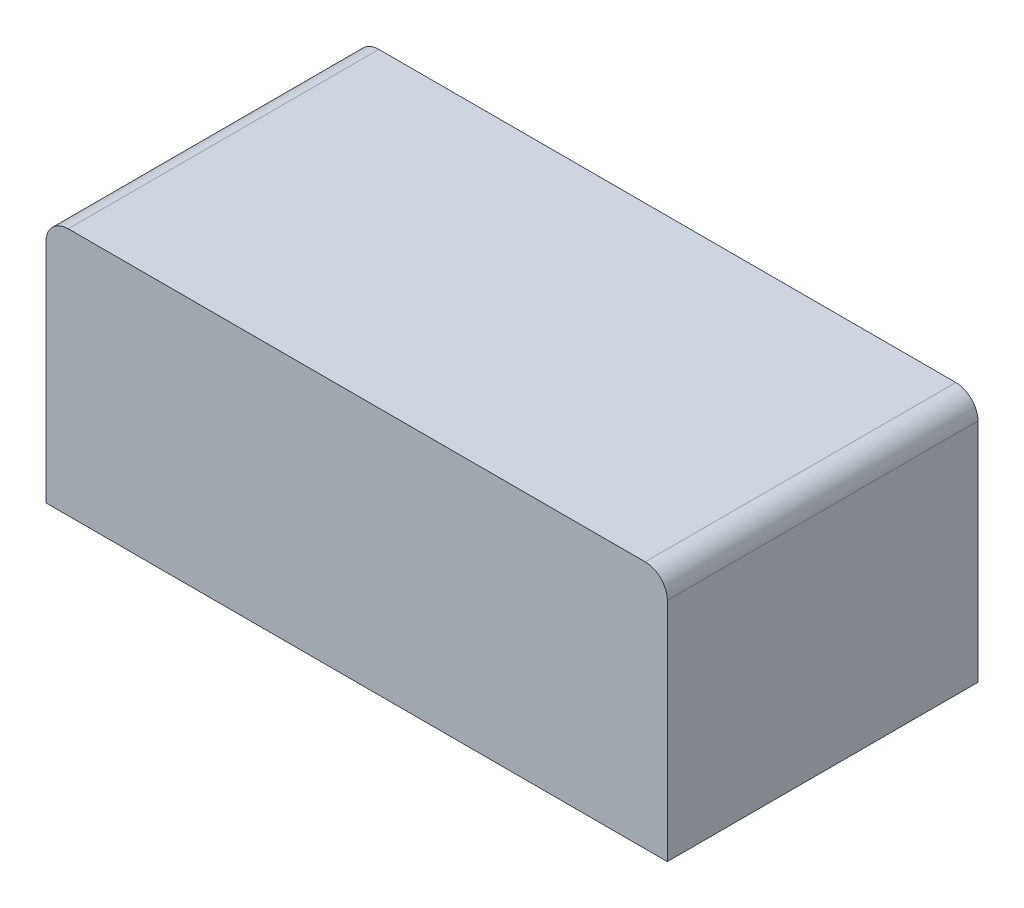
ISO-10303-21;
HEADER;
FILE_DESCRIPTION(('STEP AP214'),'2;1');
FILE_NAME('part.step','',(''),(''),'','','');
FILE_SCHEMA(('AUTOMOTIVE_DESIGN { 1 0 10303 214 1 1 1 1 }'));
ENDSEC;
DATA;
#1=APPLICATION_CONTEXT('core data for automotive mechanical design processes');
#2=APPLICATION_PROTOCOL_DEFINITION('international standard','automotive_design',2000,#1);
#3=PRODUCT_CONTEXT('',#1,'mechanical');
#4=PRODUCT('Part','Part','',(#3));
#5=PRODUCT_RELATED_PRODUCT_CATEGORY('part','',(#4));
#6=PRODUCT_DEFINITION_FORMATION('','',#4);
#7=PRODUCT_DEFINITION_CONTEXT('part definition',#1,'design');
#8=PRODUCT_DEFINITION('design','',#6,#7);
#9=PRODUCT_DEFINITION_SHAPE('','',#8);
#10=(LENGTH_UNIT() NAMED_UNIT(*) SI_UNIT(.MILLI.,.METRE.));
#11=(NAMED_UNIT(*) PLANE_ANGLE_UNIT() SI_UNIT($,.RADIAN.));
#12=(NAMED_UNIT(*) SI_UNIT($,.STERADIAN.) SOLID_ANGLE_UNIT());
#13=UNCERTAINTY_MEASURE_WITH_UNIT(LENGTH_MEASURE(1.E-05),#10,'distance_accuracy_value','');
#14=(GEOMETRIC_REPRESENTATION_CONTEXT(3) GLOBAL_UNCERTAINTY_ASSIGNED_CONTEXT((#13)) GLOBAL_UNIT_ASSIGNED_CONTEXT((#10,
#11,#12)) REPRESENTATION_CONTEXT('',''));
#15=CARTESIAN_POINT('',(0.,0.,0.));
#16=DIRECTION('',(0.,0.,1.));
#17=DIRECTION('',(1.,0.,0.));
#18=AXIS2_PLACEMENT_3D('',#15,#16,#17);
#19=CARTESIAN_POINT('',(24.1335140873094,-3.67124998633488,-5.58808410698079));
#20=DIRECTION('',(0.,0.,1.));
#21=DIRECTION('',(1.,0.,0.));
#22=AXIS2_PLACEMENT_3D('',#19,#20,#21);
#23=CYLINDRICAL_SURFACE('',#22,0.1);
#24=CARTESIAN_POINT('',(24.1335140873094,-3.67124998633488,-5.58808410698079));
#25=DIRECTION('',(0.,0.,1.));
#26=DIRECTION('',(1.,0.,0.));
#27=AXIS2_PLACEMENT_3D('',#24,#25,#26);
#28=CIRCLE('',#27,0.1);
#29=CARTESIAN_POINT('',(24.0335140873094,-3.67124998633488,-5.58808410698079));
#30=VERTEX_POINT('',#29);
#31=CARTESIAN_POINT('',(24.1335140873094,-3.57124998633488,-5.58808410698079));
#32=VERTEX_POINT('',#31);
#33=EDGE_CURVE('E99',#30,#32,#28,.F.);
#34=ORIENTED_EDGE('',*,*,#33,.T.);
#35=DIRECTION('',(0.,0.,-1.));
#36=VECTOR('',#35,1.);
#37=CARTESIAN_POINT('',(24.1335140873094,-3.57124998633488,-5.58808410698079));
#38=LINE('',#37,#36);
#39=CARTESIAN_POINT('',(24.1335140873094,-3.57124998633488,-6.98808410698078));
#40=VERTEX_POINT('',#39);
#41=EDGE_CURVE('E74',#32,#40,#38,.T.);
#42=ORIENTED_EDGE('',*,*,#41,.T.);
#43=CARTESIAN_POINT('',(24.1335140873094,-3.67124998633488,-6.98808410698079));
#44=DIRECTION('',(0.,0.,1.));
#45=DIRECTION('',(1.,0.,0.));
#46=AXIS2_PLACEMENT_3D('',#43,#44,#45);
#47=CIRCLE('',#46,0.1);
#48=CARTESIAN_POINT('',(24.0335140873094,-3.67124998633488,-6.98808410698078));
#49=VERTEX_POINT('',#48);
#50=EDGE_CURVE('E20',#40,#49,#47,.T.);
#51=ORIENTED_EDGE('',*,*,#50,.T.);
#52=DIRECTION('',(0.,0.,-1.));
#53=VECTOR('',#52,1.);
#54=CARTESIAN_POINT('',(24.0335140873094,-3.67124998633488,-5.58808410698079));
#55=LINE('',#54,#53);
#56=EDGE_CURVE('E71',#49,#30,#55,.F.);
#57=ORIENTED_EDGE('',*,*,#56,.T.);
#58=EDGE_LOOP('',(#34,#42,#51,#57));
#59=FACE_BOUND('',#58,.T.);
#60=ADVANCED_FACE('F17',(#59),#23,.T.);
#61=CARTESIAN_POINT('',(24.0335140873094,-3.57124998633488,-5.58808410698079));
#62=DIRECTION('',(0.,-1.,0.));
#63=DIRECTION('',(0.,0.,-1.));
#64=AXIS2_PLACEMENT_3D('',#61,#62,#63);
#65=PLANE('',#64);
#66=DIRECTION('',(0.,0.,-1.));
#67=VECTOR('',#66,1.);
#68=CARTESIAN_POINT('',(26.7335140873094,-3.57124998633488,-5.58808410698079));
#69=LINE('',#68,#67);
#70=CARTESIAN_POINT('',(26.7335140873094,-3.57124998633488,-6.98808410698078));
#71=VERTEX_POINT('',#70);
#72=CARTESIAN_POINT('',(26.7335140873094,-3.57124998633488,-5.58808410698079));
#73=VERTEX_POINT('',#72);
#74=EDGE_CURVE('E122',#71,#73,#69,.F.);
#75=ORIENTED_EDGE('',*,*,#74,.F.);
#76=DIRECTION('',(1.,0.,0.));
#77=VECTOR('',#76,1.);
#78=CARTESIAN_POINT('',(26.8335140873094,-3.57124998633488,-6.98808410698078));
#79=LINE('',#78,#77);
#80=EDGE_CURVE('E90',#71,#40,#79,.F.);
#81=ORIENTED_EDGE('',*,*,#80,.T.);
#82=ORIENTED_EDGE('',*,*,#41,.F.);
#83=DIRECTION('',(-1.,0.,0.));
#84=VECTOR('',#83,1.);
#85=CARTESIAN_POINT('',(26.8335140873094,-3.57124998633488,-5.58808410698079));
#86=LINE('',#85,#84);
#87=EDGE_CURVE('E97',#32,#73,#86,.F.);
#88=ORIENTED_EDGE('',*,*,#87,.T.);
#89=EDGE_LOOP('',(#75,#81,#82,#88));
#90=FACE_BOUND('',#89,.T.);
#91=ADVANCED_FACE('F133',(#90),#65,.F.);
#92=CARTESIAN_POINT('',(26.7335140873094,-3.67124998633488,-5.58808410698079));
#93=DIRECTION('',(0.,0.,-1.));
#94=DIRECTION('',(-1.,0.,0.));
#95=AXIS2_PLACEMENT_3D('',#92,#93,#94);
#96=CYLINDRICAL_SURFACE('',#95,0.1);
#97=CARTESIAN_POINT('',(26.7335140873094,-3.67124998633488,-6.98808410698078));
#98=DIRECTION('',(0.,0.,-1.));
#99=DIRECTION('',(-1.,0.,0.));
#100=AXIS2_PLACEMENT_3D('',#97,#98,#99);
#101=CIRCLE('',#100,0.1);
#102=CARTESIAN_POINT('',(26.8335140873094,-3.67124998633488,-6.98808410698078));
#103=VERTEX_POINT('',#102);
#104=EDGE_CURVE('E87',#103,#71,#101,.F.);
#105=ORIENTED_EDGE('',*,*,#104,.T.);
#106=ORIENTED_EDGE('',*,*,#74,.T.);
#107=CARTESIAN_POINT('',(26.7335140873094,-3.67124998633488,-5.58808410698079));
#108=DIRECTION('',(0.,0.,-1.));
#109=DIRECTION('',(-1.,0.,0.));
#110=AXIS2_PLACEMENT_3D('',#107,#108,#109);
#111=CIRCLE('',#110,0.1);
#112=CARTESIAN_POINT('',(26.8335140873094,-3.67124998633488,-5.58808410698079));
#113=VERTEX_POINT('',#112);
#114=EDGE_CURVE('E82',#73,#113,#111,.T.);
#115=ORIENTED_EDGE('',*,*,#114,.T.);
#116=DIRECTION('',(0.,0.,1.));
#117=VECTOR('',#116,1.);
#118=CARTESIAN_POINT('',(26.8335140873094,-3.67124998633488,-5.58808410698079));
#119=LINE('',#118,#117);
#120=EDGE_CURVE('E100',#113,#103,#119,.F.);
#121=ORIENTED_EDGE('',*,*,#120,.T.);
#122=EDGE_LOOP('',(#105,#106,#115,#121));
#123=FACE_BOUND('',#122,.T.);
#124=ADVANCED_FACE('F139',(#123),#96,.T.);
#125=CARTESIAN_POINT('',(26.8335140873094,-3.57124998633488,-5.58808410698079));
#126=DIRECTION('',(0.,0.,-1.));
#127=DIRECTION('',(-1.,0.,0.));
#128=AXIS2_PLACEMENT_3D('',#125,#126,#127);
#129=PLANE('',#128);
#130=ORIENTED_EDGE('',*,*,#114,.F.);
#131=ORIENTED_EDGE('',*,*,#87,.F.);
#132=ORIENTED_EDGE('',*,*,#33,.F.);
#133=DIRECTION('',(0.,1.,0.));
#134=VECTOR('',#133,1.);
#135=CARTESIAN_POINT('',(24.0335140873094,-3.57124998633488,-5.58808410698079));
#136=LINE('',#135,#134);
#137=CARTESIAN_POINT('',(24.0335140873094,-4.69124998633488,-5.58808410698079));
#138=VERTEX_POINT('',#137);
#139=EDGE_CURVE('E81',#30,#138,#136,.F.);
#140=ORIENTED_EDGE('',*,*,#139,.T.);
#141=DIRECTION('',(1.,0.,0.));
#142=VECTOR('',#141,1.);
#143=CARTESIAN_POINT('',(24.0335140873094,-4.69124998633488,-5.58808410698079));
#144=LINE('',#143,#142);
#145=CARTESIAN_POINT('',(26.8335140873094,-4.69124998633488,-5.58808410698079));
#146=VERTEX_POINT('',#145);
#147=EDGE_CURVE('E104',#146,#138,#144,.F.);
#148=ORIENTED_EDGE('',*,*,#147,.F.);
#149=DIRECTION('',(0.,1.,0.));
#150=VECTOR('',#149,1.);
#151=CARTESIAN_POINT('',(26.8335140873094,-3.57124998633488,-5.58808410698079));
#152=LINE('',#151,#150);
#153=EDGE_CURVE('E102',#146,#113,#152,.T.);
#154=ORIENTED_EDGE('',*,*,#153,.T.);
#155=EDGE_LOOP('',(#130,#131,#132,#140,#148,#154));
#156=FACE_BOUND('',#155,.T.);
#157=ADVANCED_FACE('F135',(#156),#129,.F.);
#158=CARTESIAN_POINT('',(24.0335140873094,-3.57124998633488,-5.58808410698079));
#159=DIRECTION('',(1.,0.,0.));
#160=DIRECTION('',(0.,0.,-1.));
#161=AXIS2_PLACEMENT_3D('',#158,#159,#160);
#162=PLANE('',#161);
#163=ORIENTED_EDGE('',*,*,#56,.F.);
#164=DIRECTION('',(0.,1.,0.));
#165=VECTOR('',#164,1.);
#166=CARTESIAN_POINT('',(24.0335140873094,-3.57124998633488,-6.98808410698078));
#167=LINE('',#166,#165);
#168=CARTESIAN_POINT('',(24.0335140873094,-4.69124998633488,-6.98808410698078));
#169=VERTEX_POINT('',#168);
#170=EDGE_CURVE('E80',#49,#169,#167,.F.);
#171=ORIENTED_EDGE('',*,*,#170,.T.);
#172=DIRECTION('',(0.,0.,-1.));
#173=VECTOR('',#172,1.);
#174=CARTESIAN_POINT('',(24.0335140873094,-4.69124998633488,-5.58808410698079));
#175=LINE('',#174,#173);
#176=EDGE_CURVE('E110',#138,#169,#175,.T.);
#177=ORIENTED_EDGE('',*,*,#176,.F.);
#178=ORIENTED_EDGE('',*,*,#139,.F.);
#179=EDGE_LOOP('',(#163,#171,#177,#178));
#180=FACE_BOUND('',#179,.T.);
#181=ADVANCED_FACE('F78',(#180),#162,.F.);
#182=CARTESIAN_POINT('',(26.8335140873094,-3.57124998633488,-6.98808410698078));
#183=DIRECTION('',(0.,0.,1.));
#184=DIRECTION('',(1.,0.,0.));
#185=AXIS2_PLACEMENT_3D('',#182,#183,#184);
#186=PLANE('',#185);
#187=ORIENTED_EDGE('',*,*,#104,.F.);
#188=DIRECTION('',(0.,1.,0.));
#189=VECTOR('',#188,1.);
#190=CARTESIAN_POINT('',(26.8335140873094,-3.57124998633488,-6.98808410698078));
#191=LINE('',#190,#189);
#192=CARTESIAN_POINT('',(26.8335140873094,-4.69124998633488,-6.98808410698078));
#193=VERTEX_POINT('',#192);
#194=EDGE_CURVE('E35',#103,#193,#191,.F.);
#195=ORIENTED_EDGE('',*,*,#194,.T.);
#196=DIRECTION('',(1.,0.,0.));
#197=VECTOR('',#196,1.);
#198=CARTESIAN_POINT('',(24.0335140873094,-4.69124998633488,-6.98808410698079));
#199=LINE('',#198,#197);
#200=EDGE_CURVE('E26',#169,#193,#199,.T.);
#201=ORIENTED_EDGE('',*,*,#200,.F.);
#202=ORIENTED_EDGE('',*,*,#170,.F.);
#203=ORIENTED_EDGE('',*,*,#50,.F.);
#204=ORIENTED_EDGE('',*,*,#80,.F.);
#205=EDGE_LOOP('',(#187,#195,#201,#202,#203,#204));
#206=FACE_BOUND('',#205,.T.);
#207=ADVANCED_FACE('F84',(#206),#186,.F.);
#208=CARTESIAN_POINT('',(26.8335140873094,-3.57124998633488,-5.58808410698079));
#209=DIRECTION('',(-1.,0.,0.));
#210=DIRECTION('',(0.,0.,1.));
#211=AXIS2_PLACEMENT_3D('',#208,#209,#210);
#212=PLANE('',#211);
#213=ORIENTED_EDGE('',*,*,#120,.F.);
#214=ORIENTED_EDGE('',*,*,#153,.F.);
#215=DIRECTION('',(0.,0.,-1.));
#216=VECTOR('',#215,1.);
#217=CARTESIAN_POINT('',(26.8335140873094,-4.69124998633488,-5.58808410698079));
#218=LINE('',#217,#216);
#219=EDGE_CURVE('E11',#193,#146,#218,.F.);
#220=ORIENTED_EDGE('',*,*,#219,.F.);
#221=ORIENTED_EDGE('',*,*,#194,.F.);
#222=EDGE_LOOP('',(#213,#214,#220,#221));
#223=FACE_BOUND('',#222,.T.);
#224=ADVANCED_FACE('F141',(#223),#212,.F.);
#225=CARTESIAN_POINT('',(24.0335140873094,-4.69124998633488,-5.58808410698079));
#226=DIRECTION('',(0.,-1.,0.));
#227=DIRECTION('',(0.,0.,-1.));
#228=AXIS2_PLACEMENT_3D('',#225,#226,#227);
#229=PLANE('',#228);
#230=ORIENTED_EDGE('',*,*,#200,.T.);
#231=ORIENTED_EDGE('',*,*,#219,.T.);
#232=ORIENTED_EDGE('',*,*,#147,.T.);
#233=ORIENTED_EDGE('',*,*,#176,.T.);
#234=EDGE_LOOP('',(#230,#231,#232,#233));
#235=FACE_BOUND('',#234,.T.);
#236=ADVANCED_FACE('F143',(#235),#229,.T.);
#237=CLOSED_SHELL('',(#60,#91,#124,#157,#181,#207,#224,#236));
#238=MANIFOLD_SOLID_BREP('B1',#237);
#239=ADVANCED_BREP_SHAPE_REPRESENTATION('',(#18,#238),#14);
#240=SHAPE_DEFINITION_REPRESENTATION(#9,#239);
ENDSEC;
END-ISO-10303-21;
